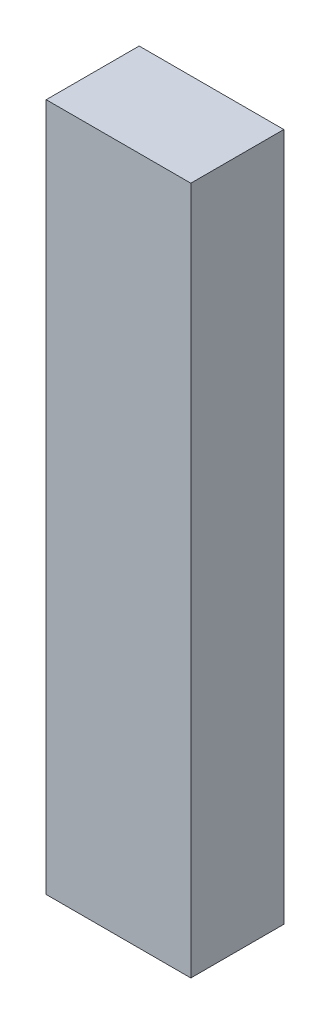
ISO-10303-21;
HEADER;
FILE_DESCRIPTION(('STEP AP214'),'2;1');
FILE_NAME('part.step','',(''),(''),'','','');
FILE_SCHEMA(('AUTOMOTIVE_DESIGN { 1 0 10303 214 1 1 1 1 }'));
ENDSEC;
DATA;
#1=APPLICATION_CONTEXT('core data for automotive mechanical design processes');
#2=APPLICATION_PROTOCOL_DEFINITION('international standard','automotive_design',2000,#1);
#3=PRODUCT_CONTEXT('',#1,'mechanical');
#4=PRODUCT('Part','Part','',(#3));
#5=PRODUCT_RELATED_PRODUCT_CATEGORY('part','',(#4));
#6=PRODUCT_DEFINITION_FORMATION('','',#4);
#7=PRODUCT_DEFINITION_CONTEXT('part definition',#1,'design');
#8=PRODUCT_DEFINITION('design','',#6,#7);
#9=PRODUCT_DEFINITION_SHAPE('','',#8);
#10=(LENGTH_UNIT() NAMED_UNIT(*) SI_UNIT(.MILLI.,.METRE.));
#11=(NAMED_UNIT(*) PLANE_ANGLE_UNIT() SI_UNIT($,.RADIAN.));
#12=(NAMED_UNIT(*) SI_UNIT($,.STERADIAN.) SOLID_ANGLE_UNIT());
#13=UNCERTAINTY_MEASURE_WITH_UNIT(LENGTH_MEASURE(1.E-05),#10,'distance_accuracy_value','');
#14=(GEOMETRIC_REPRESENTATION_CONTEXT(3) GLOBAL_UNCERTAINTY_ASSIGNED_CONTEXT((#13)) GLOBAL_UNIT_ASSIGNED_CONTEXT((#10,
#11,#12)) REPRESENTATION_CONTEXT('',''));
#15=CARTESIAN_POINT('',(0.,0.,0.));
#16=DIRECTION('',(0.,0.,1.));
#17=DIRECTION('',(1.,0.,0.));
#18=AXIS2_PLACEMENT_3D('',#15,#16,#17);
#19=CARTESIAN_POINT('',(35.,1000.,-22.5));
#20=DIRECTION('',(-1.,0.,0.));
#21=DIRECTION('',(0.,0.,1.));
#22=AXIS2_PLACEMENT_3D('',#19,#20,#21);
#23=PLANE('',#22);
#24=DIRECTION('',(0.,0.,1.));
#25=VECTOR('',#24,1.);
#26=CARTESIAN_POINT('',(35.,666.851692928733,-22.5));
#27=LINE('',#26,#25);
#28=CARTESIAN_POINT('',(35.,666.851692928733,-22.5));
#29=VERTEX_POINT('',#28);
#30=CARTESIAN_POINT('',(35.,666.851692928733,22.5));
#31=VERTEX_POINT('',#30);
#32=EDGE_CURVE('E46',#29,#31,#27,.T.);
#33=ORIENTED_EDGE('',*,*,#32,.F.);
#34=DIRECTION('',(0.,-1.,0.));
#35=VECTOR('',#34,1.);
#36=CARTESIAN_POINT('',(35.,1000.,-22.5));
#37=LINE('',#36,#35);
#38=CARTESIAN_POINT('',(35.,1000.,-22.5));
#39=VERTEX_POINT('',#38);
#40=EDGE_CURVE('E40',#39,#29,#37,.T.);
#41=ORIENTED_EDGE('',*,*,#40,.F.);
#42=DIRECTION('',(0.,0.,-1.));
#43=VECTOR('',#42,1.);
#44=CARTESIAN_POINT('',(35.,1000.,-22.5));
#45=LINE('',#44,#43);
#46=CARTESIAN_POINT('',(35.,1000.,22.5));
#47=VERTEX_POINT('',#46);
#48=EDGE_CURVE('E101',#47,#39,#45,.T.);
#49=ORIENTED_EDGE('',*,*,#48,.F.);
#50=DIRECTION('',(0.,-1.,0.));
#51=VECTOR('',#50,1.);
#52=CARTESIAN_POINT('',(35.,1000.,22.5));
#53=LINE('',#52,#51);
#54=EDGE_CURVE('E92',#47,#31,#53,.T.);
#55=ORIENTED_EDGE('',*,*,#54,.T.);
#56=EDGE_LOOP('',(#33,#41,#49,#55));
#57=FACE_BOUND('',#56,.T.);
#58=ADVANCED_FACE('F33',(#57),#23,.F.);
#59=CARTESIAN_POINT('',(-35.,1000.,-22.5));
#60=DIRECTION('',(0.,0.,1.));
#61=DIRECTION('',(1.,0.,0.));
#62=AXIS2_PLACEMENT_3D('',#59,#60,#61);
#63=PLANE('',#62);
#64=DIRECTION('',(1.,0.,0.));
#65=VECTOR('',#64,1.);
#66=CARTESIAN_POINT('',(-5.44378017279224E-13,666.851692928733,-22.5));
#67=LINE('',#66,#65);
#68=CARTESIAN_POINT('',(-35.,666.851692928733,-22.5));
#69=VERTEX_POINT('',#68);
#70=EDGE_CURVE('E74',#69,#29,#67,.T.);
#71=ORIENTED_EDGE('',*,*,#70,.F.);
#72=DIRECTION('',(0.,-1.,0.));
#73=VECTOR('',#72,1.);
#74=CARTESIAN_POINT('',(-35.,1000.,-22.5));
#75=LINE('',#74,#73);
#76=CARTESIAN_POINT('',(-35.,1000.,-22.5));
#77=VERTEX_POINT('',#76);
#78=EDGE_CURVE('E84',#77,#69,#75,.T.);
#79=ORIENTED_EDGE('',*,*,#78,.F.);
#80=DIRECTION('',(-1.,0.,0.));
#81=VECTOR('',#80,1.);
#82=CARTESIAN_POINT('',(-35.,1000.,-22.5));
#83=LINE('',#82,#81);
#84=EDGE_CURVE('E99',#39,#77,#83,.T.);
#85=ORIENTED_EDGE('',*,*,#84,.F.);
#86=ORIENTED_EDGE('',*,*,#40,.T.);
#87=EDGE_LOOP('',(#71,#79,#85,#86));
#88=FACE_BOUND('',#87,.T.);
#89=ADVANCED_FACE('F83',(#88),#63,.F.);
#90=CARTESIAN_POINT('',(-35.,1000.,-22.5));
#91=DIRECTION('',(1.,0.,0.));
#92=DIRECTION('',(0.,0.,-1.));
#93=AXIS2_PLACEMENT_3D('',#90,#91,#92);
#94=PLANE('',#93);
#95=DIRECTION('',(0.,0.,1.));
#96=VECTOR('',#95,1.);
#97=CARTESIAN_POINT('',(-35.,666.851692928733,-22.5));
#98=LINE('',#97,#96);
#99=CARTESIAN_POINT('',(-35.,666.851692928733,22.5));
#100=VERTEX_POINT('',#99);
#101=EDGE_CURVE('E71',#69,#100,#98,.T.);
#102=ORIENTED_EDGE('',*,*,#101,.T.);
#103=DIRECTION('',(0.,-1.,0.));
#104=VECTOR('',#103,1.);
#105=CARTESIAN_POINT('',(-35.,1000.,22.5));
#106=LINE('',#105,#104);
#107=CARTESIAN_POINT('',(-35.,1000.,22.5));
#108=VERTEX_POINT('',#107);
#109=EDGE_CURVE('E90',#108,#100,#106,.T.);
#110=ORIENTED_EDGE('',*,*,#109,.F.);
#111=DIRECTION('',(0.,0.,1.));
#112=VECTOR('',#111,1.);
#113=CARTESIAN_POINT('',(-35.,1000.,-22.5));
#114=LINE('',#113,#112);
#115=EDGE_CURVE('E89',#77,#108,#114,.T.);
#116=ORIENTED_EDGE('',*,*,#115,.F.);
#117=ORIENTED_EDGE('',*,*,#78,.T.);
#118=EDGE_LOOP('',(#102,#110,#116,#117));
#119=FACE_BOUND('',#118,.T.);
#120=ADVANCED_FACE('F88',(#119),#94,.F.);
#121=CARTESIAN_POINT('',(-35.,1000.,22.5));
#122=DIRECTION('',(0.,0.,-1.));
#123=DIRECTION('',(-1.,0.,0.));
#124=AXIS2_PLACEMENT_3D('',#121,#122,#123);
#125=PLANE('',#124);
#126=DIRECTION('',(-1.,0.,0.));
#127=VECTOR('',#126,1.);
#128=CARTESIAN_POINT('',(-34.9999999999997,666.851692928733,22.5));
#129=LINE('',#128,#127);
#130=EDGE_CURVE('E11',#31,#100,#129,.T.);
#131=ORIENTED_EDGE('',*,*,#130,.F.);
#132=ORIENTED_EDGE('',*,*,#54,.F.);
#133=DIRECTION('',(1.,0.,0.));
#134=VECTOR('',#133,1.);
#135=CARTESIAN_POINT('',(-35.,1000.,22.5));
#136=LINE('',#135,#134);
#137=EDGE_CURVE('E54',#108,#47,#136,.T.);
#138=ORIENTED_EDGE('',*,*,#137,.F.);
#139=ORIENTED_EDGE('',*,*,#109,.T.);
#140=EDGE_LOOP('',(#131,#132,#138,#139));
#141=FACE_BOUND('',#140,.T.);
#142=ADVANCED_FACE('F107',(#141),#125,.F.);
#143=CARTESIAN_POINT('',(0.,1000.,0.));
#144=DIRECTION('',(0.,1.,0.));
#145=DIRECTION('',(0.,0.,1.));
#146=AXIS2_PLACEMENT_3D('',#143,#144,#145);
#147=PLANE('',#146);
#148=ORIENTED_EDGE('',*,*,#48,.T.);
#149=ORIENTED_EDGE('',*,*,#84,.T.);
#150=ORIENTED_EDGE('',*,*,#115,.T.);
#151=ORIENTED_EDGE('',*,*,#137,.T.);
#152=EDGE_LOOP('',(#148,#149,#150,#151));
#153=FACE_BOUND('',#152,.T.);
#154=ADVANCED_FACE('F104',(#153),#147,.T.);
#155=CARTESIAN_POINT('',(-5.44378017279224E-13,666.851692928733,-22.5));
#156=DIRECTION('',(0.,-1.,0.));
#157=DIRECTION('',(1.,0.,0.));
#158=AXIS2_PLACEMENT_3D('',#155,#156,#157);
#159=PLANE('',#158);
#160=ORIENTED_EDGE('',*,*,#130,.T.);
#161=ORIENTED_EDGE('',*,*,#101,.F.);
#162=ORIENTED_EDGE('',*,*,#70,.T.);
#163=ORIENTED_EDGE('',*,*,#32,.T.);
#164=EDGE_LOOP('',(#160,#161,#162,#163));
#165=FACE_BOUND('',#164,.T.);
#166=ADVANCED_FACE('F73',(#165),#159,.T.);
#167=CLOSED_SHELL('',(#58,#89,#120,#142,#154,#166));
#168=MANIFOLD_SOLID_BREP('B2',#167);
#169=ADVANCED_BREP_SHAPE_REPRESENTATION('',(#18,#168),#14);
#170=SHAPE_DEFINITION_REPRESENTATION(#9,#169);
ENDSEC;
END-ISO-10303-21;
